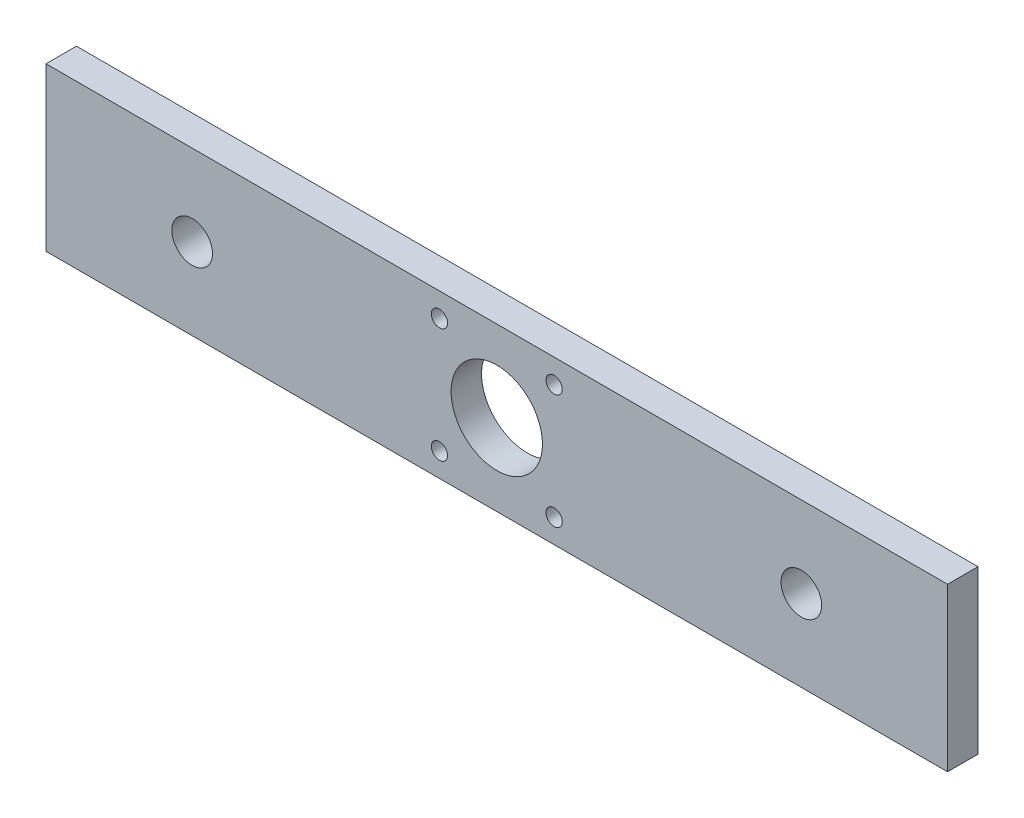
ISO-10303-21;
HEADER;
FILE_DESCRIPTION(('STEP AP214'),'2;1');
FILE_NAME('part.step','',(''),(''),'','','');
FILE_SCHEMA(('AUTOMOTIVE_DESIGN { 1 0 10303 214 1 1 1 1 }'));
ENDSEC;
DATA;
#1=APPLICATION_CONTEXT('core data for automotive mechanical design processes');
#2=APPLICATION_PROTOCOL_DEFINITION('international standard','automotive_design',2000,#1);
#3=PRODUCT_CONTEXT('',#1,'mechanical');
#4=PRODUCT('Part','Part','',(#3));
#5=PRODUCT_RELATED_PRODUCT_CATEGORY('part','',(#4));
#6=PRODUCT_DEFINITION_FORMATION('','',#4);
#7=PRODUCT_DEFINITION_CONTEXT('part definition',#1,'design');
#8=PRODUCT_DEFINITION('design','',#6,#7);
#9=PRODUCT_DEFINITION_SHAPE('','',#8);
#10=(LENGTH_UNIT() NAMED_UNIT(*) SI_UNIT(.MILLI.,.METRE.));
#11=(NAMED_UNIT(*) PLANE_ANGLE_UNIT() SI_UNIT($,.RADIAN.));
#12=(NAMED_UNIT(*) SI_UNIT($,.STERADIAN.) SOLID_ANGLE_UNIT());
#13=UNCERTAINTY_MEASURE_WITH_UNIT(LENGTH_MEASURE(1.E-05),#10,'distance_accuracy_value','');
#14=(GEOMETRIC_REPRESENTATION_CONTEXT(3) GLOBAL_UNCERTAINTY_ASSIGNED_CONTEXT((#13)) GLOBAL_UNIT_ASSIGNED_CONTEXT((#10,
#11,#12)) REPRESENTATION_CONTEXT('',''));
#15=CARTESIAN_POINT('',(0.,0.,0.));
#16=DIRECTION('',(0.,0.,1.));
#17=DIRECTION('',(1.,0.,0.));
#18=AXIS2_PLACEMENT_3D('',#15,#16,#17);
#19=CARTESIAN_POINT('',(222.,-40.,-15.));
#20=DIRECTION('',(1.,0.,0.));
#21=DIRECTION('',(0.,0.,-1.));
#22=AXIS2_PLACEMENT_3D('',#19,#20,#21);
#23=PLANE('',#22);
#24=DIRECTION('',(0.,1.,0.));
#25=VECTOR('',#24,1.);
#26=CARTESIAN_POINT('',(222.,-40.,0.));
#27=LINE('',#26,#25);
#28=CARTESIAN_POINT('',(222.,-40.,0.));
#29=VERTEX_POINT('',#28);
#30=CARTESIAN_POINT('',(222.,40.,0.));
#31=VERTEX_POINT('',#30);
#32=EDGE_CURVE('E98',#29,#31,#27,.T.);
#33=ORIENTED_EDGE('',*,*,#32,.F.);
#34=DIRECTION('',(0.,0.,1.));
#35=VECTOR('',#34,1.);
#36=CARTESIAN_POINT('',(222.,-40.,-15.));
#37=LINE('',#36,#35);
#38=CARTESIAN_POINT('',(222.,-40.,-15.));
#39=VERTEX_POINT('',#38);
#40=EDGE_CURVE('E11',#39,#29,#37,.T.);
#41=ORIENTED_EDGE('',*,*,#40,.F.);
#42=DIRECTION('',(0.,1.,0.));
#43=VECTOR('',#42,1.);
#44=CARTESIAN_POINT('',(222.,-40.,-15.));
#45=LINE('',#44,#43);
#46=CARTESIAN_POINT('',(222.,40.,-15.));
#47=VERTEX_POINT('',#46);
#48=EDGE_CURVE('E91',#39,#47,#45,.T.);
#49=ORIENTED_EDGE('',*,*,#48,.T.);
#50=DIRECTION('',(0.,0.,1.));
#51=VECTOR('',#50,1.);
#52=CARTESIAN_POINT('',(222.,40.,-15.));
#53=LINE('',#52,#51);
#54=EDGE_CURVE('E36',#47,#31,#53,.T.);
#55=ORIENTED_EDGE('',*,*,#54,.T.);
#56=EDGE_LOOP('',(#33,#41,#49,#55));
#57=FACE_BOUND('',#56,.T.);
#58=ADVANCED_FACE('F33',(#57),#23,.T.);
#59=CARTESIAN_POINT('',(-222.,-40.,-15.));
#60=DIRECTION('',(0.,-1.,0.));
#61=DIRECTION('',(0.,0.,-1.));
#62=AXIS2_PLACEMENT_3D('',#59,#60,#61);
#63=PLANE('',#62);
#64=DIRECTION('',(1.,0.,0.));
#65=VECTOR('',#64,1.);
#66=CARTESIAN_POINT('',(-222.,-40.,0.));
#67=LINE('',#66,#65);
#68=CARTESIAN_POINT('',(-222.,-40.,0.));
#69=VERTEX_POINT('',#68);
#70=EDGE_CURVE('E93',#69,#29,#67,.T.);
#71=ORIENTED_EDGE('',*,*,#70,.F.);
#72=DIRECTION('',(0.,0.,1.));
#73=VECTOR('',#72,1.);
#74=CARTESIAN_POINT('',(-222.,-40.,-15.));
#75=LINE('',#74,#73);
#76=CARTESIAN_POINT('',(-222.,-40.,-15.));
#77=VERTEX_POINT('',#76);
#78=EDGE_CURVE('E42',#77,#69,#75,.T.);
#79=ORIENTED_EDGE('',*,*,#78,.F.);
#80=DIRECTION('',(1.,0.,0.));
#81=VECTOR('',#80,1.);
#82=CARTESIAN_POINT('',(-222.,-40.,-15.));
#83=LINE('',#82,#81);
#84=EDGE_CURVE('E88',#77,#39,#83,.T.);
#85=ORIENTED_EDGE('',*,*,#84,.T.);
#86=ORIENTED_EDGE('',*,*,#40,.T.);
#87=EDGE_LOOP('',(#71,#79,#85,#86));
#88=FACE_BOUND('',#87,.T.);
#89=ADVANCED_FACE('F109',(#88),#63,.T.);
#90=CARTESIAN_POINT('',(-222.,-40.,-15.));
#91=DIRECTION('',(-1.,0.,0.));
#92=DIRECTION('',(0.,0.,1.));
#93=AXIS2_PLACEMENT_3D('',#90,#91,#92);
#94=PLANE('',#93);
#95=DIRECTION('',(0.,-1.,0.));
#96=VECTOR('',#95,1.);
#97=CARTESIAN_POINT('',(-222.,-40.,0.));
#98=LINE('',#97,#96);
#99=CARTESIAN_POINT('',(-222.,39.9999999999999,0.));
#100=VERTEX_POINT('',#99);
#101=EDGE_CURVE('E83',#100,#69,#98,.T.);
#102=ORIENTED_EDGE('',*,*,#101,.F.);
#103=DIRECTION('',(0.,0.,1.));
#104=VECTOR('',#103,1.);
#105=CARTESIAN_POINT('',(-222.,39.9999999999999,-15.));
#106=LINE('',#105,#104);
#107=CARTESIAN_POINT('',(-222.,39.9999999999999,-15.));
#108=VERTEX_POINT('',#107);
#109=EDGE_CURVE('E78',#108,#100,#106,.T.);
#110=ORIENTED_EDGE('',*,*,#109,.F.);
#111=DIRECTION('',(0.,-1.,0.));
#112=VECTOR('',#111,1.);
#113=CARTESIAN_POINT('',(-222.,-40.,-15.));
#114=LINE('',#113,#112);
#115=EDGE_CURVE('E81',#108,#77,#114,.T.);
#116=ORIENTED_EDGE('',*,*,#115,.T.);
#117=ORIENTED_EDGE('',*,*,#78,.T.);
#118=EDGE_LOOP('',(#102,#110,#116,#117));
#119=FACE_BOUND('',#118,.T.);
#120=ADVANCED_FACE('F80',(#119),#94,.T.);
#121=CARTESIAN_POINT('',(-222.,39.9999999999999,-15.));
#122=DIRECTION('',(0.,1.,0.));
#123=DIRECTION('',(-1.,0.,0.));
#124=AXIS2_PLACEMENT_3D('',#121,#122,#123);
#125=PLANE('',#124);
#126=DIRECTION('',(-1.,0.,0.));
#127=VECTOR('',#126,1.);
#128=CARTESIAN_POINT('',(-222.,39.9999999999999,0.));
#129=LINE('',#128,#127);
#130=EDGE_CURVE('E101',#31,#100,#129,.T.);
#131=ORIENTED_EDGE('',*,*,#130,.F.);
#132=ORIENTED_EDGE('',*,*,#54,.F.);
#133=DIRECTION('',(-1.,0.,0.));
#134=VECTOR('',#133,1.);
#135=CARTESIAN_POINT('',(-222.,39.9999999999999,-15.));
#136=LINE('',#135,#134);
#137=EDGE_CURVE('E87',#47,#108,#136,.T.);
#138=ORIENTED_EDGE('',*,*,#137,.T.);
#139=ORIENTED_EDGE('',*,*,#109,.T.);
#140=EDGE_LOOP('',(#131,#132,#138,#139));
#141=FACE_BOUND('',#140,.T.);
#142=ADVANCED_FACE('F90',(#141),#125,.T.);
#143=CARTESIAN_POINT('',(0.,0.,-15.));
#144=DIRECTION('',(0.,0.,-1.));
#145=DIRECTION('',(-1.,0.,0.));
#146=AXIS2_PLACEMENT_3D('',#143,#144,#145);
#147=PLANE('',#146);
#148=CARTESIAN_POINT('',(150.,0.,-15.));
#149=DIRECTION('',(0.,0.,1.));
#150=DIRECTION('',(1.,0.,0.));
#151=AXIS2_PLACEMENT_3D('',#148,#149,#150);
#152=CIRCLE('',#151,10.);
#153=CARTESIAN_POINT('',(160.,0.,-15.));
#154=VERTEX_POINT('',#153);
#155=EDGE_CURVE('E162',#154,#154,#152,.T.);
#156=ORIENTED_EDGE('',*,*,#155,.T.);
#157=EDGE_LOOP('',(#156));
#158=FACE_BOUND('',#157,.T.);
#159=CARTESIAN_POINT('',(-150.,0.,-15.));
#160=DIRECTION('',(0.,0.,1.));
#161=DIRECTION('',(1.,0.,0.));
#162=AXIS2_PLACEMENT_3D('',#159,#160,#161);
#163=CIRCLE('',#162,10.);
#164=CARTESIAN_POINT('',(-140.,0.,-15.));
#165=VERTEX_POINT('',#164);
#166=EDGE_CURVE('E170',#165,#165,#163,.T.);
#167=ORIENTED_EDGE('',*,*,#166,.T.);
#168=EDGE_LOOP('',(#167));
#169=FACE_BOUND('',#168,.T.);
#170=CARTESIAN_POINT('',(-28.25,-28.25,-15.));
#171=DIRECTION('',(0.,0.,1.));
#172=DIRECTION('',(1.,0.,0.));
#173=AXIS2_PLACEMENT_3D('',#170,#171,#172);
#174=CIRCLE('',#173,4.);
#175=CARTESIAN_POINT('',(-24.25,-28.25,-15.));
#176=VERTEX_POINT('',#175);
#177=EDGE_CURVE('E176',#176,#176,#174,.T.);
#178=ORIENTED_EDGE('',*,*,#177,.T.);
#179=EDGE_LOOP('',(#178));
#180=FACE_BOUND('',#179,.T.);
#181=CARTESIAN_POINT('',(28.25,-28.25,-15.));
#182=DIRECTION('',(0.,0.,1.));
#183=DIRECTION('',(1.,0.,0.));
#184=AXIS2_PLACEMENT_3D('',#181,#182,#183);
#185=CIRCLE('',#184,4.);
#186=CARTESIAN_POINT('',(32.25,-28.25,-15.));
#187=VERTEX_POINT('',#186);
#188=EDGE_CURVE('E182',#187,#187,#185,.T.);
#189=ORIENTED_EDGE('',*,*,#188,.T.);
#190=EDGE_LOOP('',(#189));
#191=FACE_BOUND('',#190,.T.);
#192=CARTESIAN_POINT('',(-28.25,28.25,-15.));
#193=DIRECTION('',(0.,0.,1.));
#194=DIRECTION('',(1.,0.,0.));
#195=AXIS2_PLACEMENT_3D('',#192,#193,#194);
#196=CIRCLE('',#195,4.);
#197=CARTESIAN_POINT('',(-24.25,28.25,-15.));
#198=VERTEX_POINT('',#197);
#199=EDGE_CURVE('E188',#198,#198,#196,.T.);
#200=ORIENTED_EDGE('',*,*,#199,.T.);
#201=EDGE_LOOP('',(#200));
#202=FACE_BOUND('',#201,.T.);
#203=CARTESIAN_POINT('',(28.25,28.25,-15.));
#204=DIRECTION('',(0.,0.,1.));
#205=DIRECTION('',(1.,0.,0.));
#206=AXIS2_PLACEMENT_3D('',#203,#204,#205);
#207=CIRCLE('',#206,4.);
#208=CARTESIAN_POINT('',(32.25,28.25,-15.));
#209=VERTEX_POINT('',#208);
#210=EDGE_CURVE('E194',#209,#209,#207,.T.);
#211=ORIENTED_EDGE('',*,*,#210,.T.);
#212=EDGE_LOOP('',(#211));
#213=FACE_BOUND('',#212,.T.);
#214=CARTESIAN_POINT('',(0.,0.,-15.));
#215=DIRECTION('',(0.,0.,1.));
#216=DIRECTION('',(1.,0.,0.));
#217=AXIS2_PLACEMENT_3D('',#214,#215,#216);
#218=CIRCLE('',#217,22.4999999999999);
#219=CARTESIAN_POINT('',(22.4999999999999,0.,-15.));
#220=VERTEX_POINT('',#219);
#221=EDGE_CURVE('E102',#220,#220,#218,.T.);
#222=ORIENTED_EDGE('',*,*,#221,.T.);
#223=EDGE_LOOP('',(#222));
#224=FACE_BOUND('',#223,.T.);
#225=ORIENTED_EDGE('',*,*,#48,.F.);
#226=ORIENTED_EDGE('',*,*,#84,.F.);
#227=ORIENTED_EDGE('',*,*,#115,.F.);
#228=ORIENTED_EDGE('',*,*,#137,.F.);
#229=EDGE_LOOP('',(#225,#226,#227,#228));
#230=FACE_BOUND('',#229,.T.);
#231=ADVANCED_FACE('F86',(#158,#169,#180,#191,#202,#213,#224,#230),#147,.T.);
#232=CARTESIAN_POINT('',(0.,0.,0.));
#233=DIRECTION('',(0.,0.,-1.));
#234=DIRECTION('',(-1.,0.,0.));
#235=AXIS2_PLACEMENT_3D('',#232,#233,#234);
#236=PLANE('',#235);
#237=CARTESIAN_POINT('',(150.,0.,0.));
#238=DIRECTION('',(0.,0.,1.));
#239=DIRECTION('',(1.,0.,0.));
#240=AXIS2_PLACEMENT_3D('',#237,#238,#239);
#241=CIRCLE('',#240,10.);
#242=CARTESIAN_POINT('',(160.,0.,0.));
#243=VERTEX_POINT('',#242);
#244=EDGE_CURVE('E165',#243,#243,#241,.T.);
#245=ORIENTED_EDGE('',*,*,#244,.F.);
#246=EDGE_LOOP('',(#245));
#247=FACE_BOUND('',#246,.T.);
#248=CARTESIAN_POINT('',(-150.,0.,0.));
#249=DIRECTION('',(0.,0.,1.));
#250=DIRECTION('',(1.,0.,0.));
#251=AXIS2_PLACEMENT_3D('',#248,#249,#250);
#252=CIRCLE('',#251,10.);
#253=CARTESIAN_POINT('',(-140.,0.,0.));
#254=VERTEX_POINT('',#253);
#255=EDGE_CURVE('E167',#254,#254,#252,.T.);
#256=ORIENTED_EDGE('',*,*,#255,.F.);
#257=EDGE_LOOP('',(#256));
#258=FACE_BOUND('',#257,.T.);
#259=CARTESIAN_POINT('',(-28.25,-28.25,0.));
#260=DIRECTION('',(0.,0.,1.));
#261=DIRECTION('',(1.,0.,0.));
#262=AXIS2_PLACEMENT_3D('',#259,#260,#261);
#263=CIRCLE('',#262,4.);
#264=CARTESIAN_POINT('',(-24.25,-28.25,0.));
#265=VERTEX_POINT('',#264);
#266=EDGE_CURVE('E173',#265,#265,#263,.T.);
#267=ORIENTED_EDGE('',*,*,#266,.F.);
#268=EDGE_LOOP('',(#267));
#269=FACE_BOUND('',#268,.T.);
#270=CARTESIAN_POINT('',(28.25,-28.25,0.));
#271=DIRECTION('',(0.,0.,1.));
#272=DIRECTION('',(1.,0.,0.));
#273=AXIS2_PLACEMENT_3D('',#270,#271,#272);
#274=CIRCLE('',#273,4.);
#275=CARTESIAN_POINT('',(32.25,-28.25,0.));
#276=VERTEX_POINT('',#275);
#277=EDGE_CURVE('E179',#276,#276,#274,.T.);
#278=ORIENTED_EDGE('',*,*,#277,.F.);
#279=EDGE_LOOP('',(#278));
#280=FACE_BOUND('',#279,.T.);
#281=CARTESIAN_POINT('',(-28.25,28.25,0.));
#282=DIRECTION('',(0.,0.,1.));
#283=DIRECTION('',(1.,0.,0.));
#284=AXIS2_PLACEMENT_3D('',#281,#282,#283);
#285=CIRCLE('',#284,4.);
#286=CARTESIAN_POINT('',(-24.25,28.25,0.));
#287=VERTEX_POINT('',#286);
#288=EDGE_CURVE('E185',#287,#287,#285,.T.);
#289=ORIENTED_EDGE('',*,*,#288,.F.);
#290=EDGE_LOOP('',(#289));
#291=FACE_BOUND('',#290,.T.);
#292=CARTESIAN_POINT('',(28.25,28.25,0.));
#293=DIRECTION('',(0.,0.,1.));
#294=DIRECTION('',(1.,0.,0.));
#295=AXIS2_PLACEMENT_3D('',#292,#293,#294);
#296=CIRCLE('',#295,4.);
#297=CARTESIAN_POINT('',(32.25,28.25,0.));
#298=VERTEX_POINT('',#297);
#299=EDGE_CURVE('E191',#298,#298,#296,.T.);
#300=ORIENTED_EDGE('',*,*,#299,.F.);
#301=EDGE_LOOP('',(#300));
#302=FACE_BOUND('',#301,.T.);
#303=CARTESIAN_POINT('',(0.,0.,0.));
#304=DIRECTION('',(0.,0.,1.));
#305=DIRECTION('',(1.,0.,0.));
#306=AXIS2_PLACEMENT_3D('',#303,#304,#305);
#307=CIRCLE('',#306,22.4999999999999);
#308=CARTESIAN_POINT('',(22.4999999999999,0.,0.));
#309=VERTEX_POINT('',#308);
#310=EDGE_CURVE('E197',#309,#309,#307,.T.);
#311=ORIENTED_EDGE('',*,*,#310,.F.);
#312=EDGE_LOOP('',(#311));
#313=FACE_BOUND('',#312,.T.);
#314=ORIENTED_EDGE('',*,*,#32,.T.);
#315=ORIENTED_EDGE('',*,*,#130,.T.);
#316=ORIENTED_EDGE('',*,*,#101,.T.);
#317=ORIENTED_EDGE('',*,*,#70,.T.);
#318=EDGE_LOOP('',(#314,#315,#316,#317));
#319=FACE_BOUND('',#318,.T.);
#320=ADVANCED_FACE('F108',(#247,#258,#269,#280,#291,#302,#313,#319),#236,.F.);
#321=CARTESIAN_POINT('',(0.,0.,-15.));
#322=DIRECTION('',(0.,0.,1.));
#323=DIRECTION('',(1.,0.,0.));
#324=AXIS2_PLACEMENT_3D('',#321,#322,#323);
#325=CYLINDRICAL_SURFACE('',#324,22.4999999999999);
#326=ORIENTED_EDGE('',*,*,#221,.F.);
#327=EDGE_LOOP('',(#326));
#328=FACE_BOUND('',#327,.T.);
#329=ORIENTED_EDGE('',*,*,#310,.T.);
#330=EDGE_LOOP('',(#329));
#331=FACE_BOUND('',#330,.T.);
#332=ADVANCED_FACE('F127',(#328,#331),#325,.F.);
#333=CARTESIAN_POINT('',(28.25,28.25,-15.));
#334=DIRECTION('',(0.,0.,1.));
#335=DIRECTION('',(1.,0.,0.));
#336=AXIS2_PLACEMENT_3D('',#333,#334,#335);
#337=CYLINDRICAL_SURFACE('',#336,4.);
#338=ORIENTED_EDGE('',*,*,#210,.F.);
#339=EDGE_LOOP('',(#338));
#340=FACE_BOUND('',#339,.T.);
#341=ORIENTED_EDGE('',*,*,#299,.T.);
#342=EDGE_LOOP('',(#341));
#343=FACE_BOUND('',#342,.T.);
#344=ADVANCED_FACE('F134',(#340,#343),#337,.F.);
#345=CARTESIAN_POINT('',(-28.25,28.25,-15.));
#346=DIRECTION('',(0.,0.,1.));
#347=DIRECTION('',(1.,0.,0.));
#348=AXIS2_PLACEMENT_3D('',#345,#346,#347);
#349=CYLINDRICAL_SURFACE('',#348,4.);
#350=ORIENTED_EDGE('',*,*,#199,.F.);
#351=EDGE_LOOP('',(#350));
#352=FACE_BOUND('',#351,.T.);
#353=ORIENTED_EDGE('',*,*,#288,.T.);
#354=EDGE_LOOP('',(#353));
#355=FACE_BOUND('',#354,.T.);
#356=ADVANCED_FACE('F138',(#352,#355),#349,.F.);
#357=CARTESIAN_POINT('',(28.25,-28.25,-15.));
#358=DIRECTION('',(0.,0.,1.));
#359=DIRECTION('',(1.,0.,0.));
#360=AXIS2_PLACEMENT_3D('',#357,#358,#359);
#361=CYLINDRICAL_SURFACE('',#360,4.);
#362=ORIENTED_EDGE('',*,*,#188,.F.);
#363=EDGE_LOOP('',(#362));
#364=FACE_BOUND('',#363,.T.);
#365=ORIENTED_EDGE('',*,*,#277,.T.);
#366=EDGE_LOOP('',(#365));
#367=FACE_BOUND('',#366,.T.);
#368=ADVANCED_FACE('F142',(#364,#367),#361,.F.);
#369=CARTESIAN_POINT('',(-28.25,-28.25,-15.));
#370=DIRECTION('',(0.,0.,1.));
#371=DIRECTION('',(1.,0.,0.));
#372=AXIS2_PLACEMENT_3D('',#369,#370,#371);
#373=CYLINDRICAL_SURFACE('',#372,4.);
#374=ORIENTED_EDGE('',*,*,#177,.F.);
#375=EDGE_LOOP('',(#374));
#376=FACE_BOUND('',#375,.T.);
#377=ORIENTED_EDGE('',*,*,#266,.T.);
#378=EDGE_LOOP('',(#377));
#379=FACE_BOUND('',#378,.T.);
#380=ADVANCED_FACE('F146',(#376,#379),#373,.F.);
#381=CARTESIAN_POINT('',(-150.,0.,-15.));
#382=DIRECTION('',(0.,0.,1.));
#383=DIRECTION('',(1.,0.,0.));
#384=AXIS2_PLACEMENT_3D('',#381,#382,#383);
#385=CYLINDRICAL_SURFACE('',#384,10.);
#386=ORIENTED_EDGE('',*,*,#166,.F.);
#387=EDGE_LOOP('',(#386));
#388=FACE_BOUND('',#387,.T.);
#389=ORIENTED_EDGE('',*,*,#255,.T.);
#390=EDGE_LOOP('',(#389));
#391=FACE_BOUND('',#390,.T.);
#392=ADVANCED_FACE('F150',(#388,#391),#385,.F.);
#393=CARTESIAN_POINT('',(150.,0.,-15.));
#394=DIRECTION('',(0.,0.,1.));
#395=DIRECTION('',(1.,0.,0.));
#396=AXIS2_PLACEMENT_3D('',#393,#394,#395);
#397=CYLINDRICAL_SURFACE('',#396,10.);
#398=ORIENTED_EDGE('',*,*,#155,.F.);
#399=EDGE_LOOP('',(#398));
#400=FACE_BOUND('',#399,.T.);
#401=ORIENTED_EDGE('',*,*,#244,.T.);
#402=EDGE_LOOP('',(#401));
#403=FACE_BOUND('',#402,.T.);
#404=ADVANCED_FACE('F154',(#400,#403),#397,.F.);
#405=CLOSED_SHELL('',(#58,#89,#120,#142,#231,#320,#332,#344,#356,#368,#380,#392,#404));
#406=MANIFOLD_SOLID_BREP('B2',#405);
#407=ADVANCED_BREP_SHAPE_REPRESENTATION('',(#18,#406),#14);
#408=SHAPE_DEFINITION_REPRESENTATION(#9,#407);
ENDSEC;
END-ISO-10303-21;
